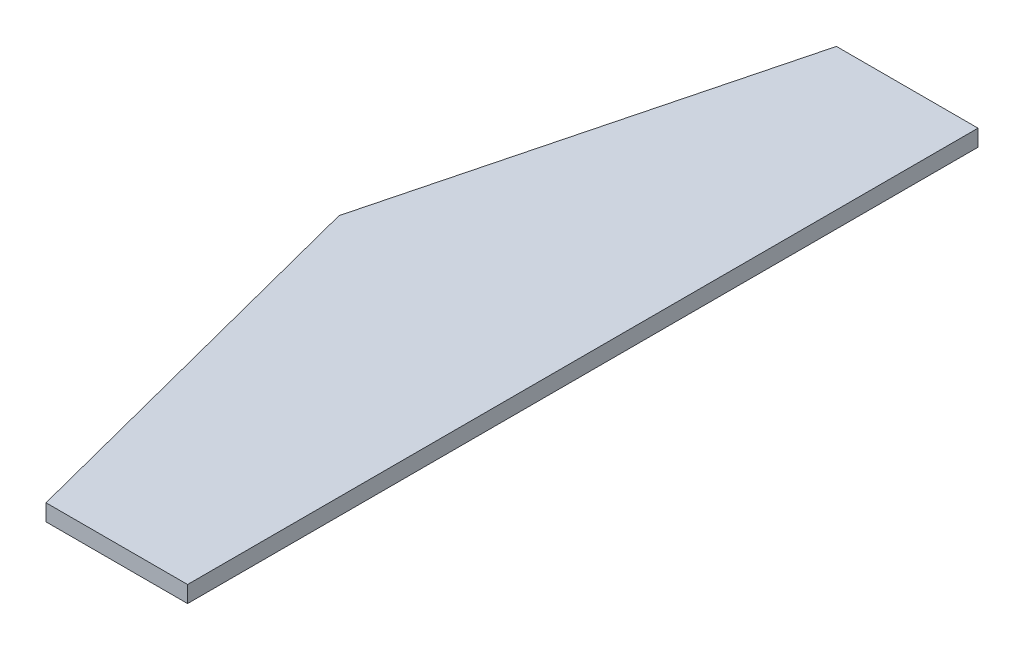
ISO-10303-21;
HEADER;
FILE_DESCRIPTION(('STEP AP214'),'2;1');
FILE_NAME('part.step','',(''),(''),'','','');
FILE_SCHEMA(('AUTOMOTIVE_DESIGN { 1 0 10303 214 1 1 1 1 }'));
ENDSEC;
DATA;
#1=APPLICATION_CONTEXT('core data for automotive mechanical design processes');
#2=APPLICATION_PROTOCOL_DEFINITION('international standard','automotive_design',2000,#1);
#3=PRODUCT_CONTEXT('',#1,'mechanical');
#4=PRODUCT('Part','Part','',(#3));
#5=PRODUCT_RELATED_PRODUCT_CATEGORY('part','',(#4));
#6=PRODUCT_DEFINITION_FORMATION('','',#4);
#7=PRODUCT_DEFINITION_CONTEXT('part definition',#1,'design');
#8=PRODUCT_DEFINITION('design','',#6,#7);
#9=PRODUCT_DEFINITION_SHAPE('','',#8);
#10=(LENGTH_UNIT() NAMED_UNIT(*) SI_UNIT(.MILLI.,.METRE.));
#11=(NAMED_UNIT(*) PLANE_ANGLE_UNIT() SI_UNIT($,.RADIAN.));
#12=(NAMED_UNIT(*) SI_UNIT($,.STERADIAN.) SOLID_ANGLE_UNIT());
#13=UNCERTAINTY_MEASURE_WITH_UNIT(LENGTH_MEASURE(1.E-05),#10,'distance_accuracy_value','');
#14=(GEOMETRIC_REPRESENTATION_CONTEXT(3) GLOBAL_UNCERTAINTY_ASSIGNED_CONTEXT((#13)) GLOBAL_UNIT_ASSIGNED_CONTEXT((#10,
#11,#12)) REPRESENTATION_CONTEXT('',''));
#15=CARTESIAN_POINT('',(0.,0.,0.));
#16=DIRECTION('',(0.,0.,1.));
#17=DIRECTION('',(1.,0.,0.));
#18=AXIS2_PLACEMENT_3D('',#15,#16,#17);
#19=CARTESIAN_POINT('',(-128.371735874381,15.,-430.296535076983));
#20=DIRECTION('',(0.,0.,1.));
#21=DIRECTION('',(1.,0.,0.));
#22=AXIS2_PLACEMENT_3D('',#19,#20,#21);
#23=PLANE('',#22);
#24=DIRECTION('',(-1.,0.,0.));
#25=VECTOR('',#24,1.);
#26=CARTESIAN_POINT('',(-128.371735874381,0.,-430.296535076983));
#27=LINE('',#26,#25);
#28=CARTESIAN_POINT('',(-5.76816563165183E-13,0.,-430.296535076982));
#29=VERTEX_POINT('',#28);
#30=CARTESIAN_POINT('',(-128.371735874381,0.,-430.296535076983));
#31=VERTEX_POINT('',#30);
#32=EDGE_CURVE('E107',#29,#31,#27,.T.);
#33=ORIENTED_EDGE('',*,*,#32,.T.);
#34=DIRECTION('',(0.,-1.,0.));
#35=VECTOR('',#34,1.);
#36=CARTESIAN_POINT('',(-128.371735874381,15.,-430.296535076983));
#37=LINE('',#36,#35);
#38=CARTESIAN_POINT('',(-128.371735874381,15.,-430.296535076983));
#39=VERTEX_POINT('',#38);
#40=EDGE_CURVE('E11',#39,#31,#37,.T.);
#41=ORIENTED_EDGE('',*,*,#40,.F.);
#42=DIRECTION('',(-1.,0.,0.));
#43=VECTOR('',#42,1.);
#44=CARTESIAN_POINT('',(-128.371735874381,15.,-430.296535076983));
#45=LINE('',#44,#43);
#46=CARTESIAN_POINT('',(-5.76816563165183E-13,15.,-430.296535076982));
#47=VERTEX_POINT('',#46);
#48=EDGE_CURVE('E115',#47,#39,#45,.T.);
#49=ORIENTED_EDGE('',*,*,#48,.F.);
#50=DIRECTION('',(0.,-1.,0.));
#51=VECTOR('',#50,1.);
#52=CARTESIAN_POINT('',(-5.76816563165183E-13,15.,-430.296535076982));
#53=LINE('',#52,#51);
#54=EDGE_CURVE('E103',#47,#29,#53,.T.);
#55=ORIENTED_EDGE('',*,*,#54,.T.);
#56=EDGE_LOOP('',(#33,#41,#49,#55));
#57=FACE_BOUND('',#56,.T.);
#58=ADVANCED_FACE('F33',(#57),#23,.F.);
#59=CARTESIAN_POINT('',(-220.987286506515,15.,-71.9465350769825));
#60=DIRECTION('',(0.968186963833413,0.,0.250227902247205));
#61=DIRECTION('',(0.250227902247205,0.,-0.968186963833413));
#62=AXIS2_PLACEMENT_3D('',#59,#60,#61);
#63=PLANE('',#62);
#64=DIRECTION('',(-0.250227902247205,0.,0.968186963833413));
#65=VECTOR('',#64,1.);
#66=CARTESIAN_POINT('',(-220.987286506515,0.,-71.9465350769825));
#67=LINE('',#66,#65);
#68=CARTESIAN_POINT('',(-220.987286506515,0.,-71.9465350769825));
#69=VERTEX_POINT('',#68);
#70=EDGE_CURVE('E110',#31,#69,#67,.T.);
#71=ORIENTED_EDGE('',*,*,#70,.T.);
#72=DIRECTION('',(0.,-1.,0.));
#73=VECTOR('',#72,1.);
#74=CARTESIAN_POINT('',(-220.987286506515,15.,-71.9465350769825));
#75=LINE('',#74,#73);
#76=CARTESIAN_POINT('',(-220.987286506515,15.,-71.9465350769825));
#77=VERTEX_POINT('',#76);
#78=EDGE_CURVE('E41',#77,#69,#75,.T.);
#79=ORIENTED_EDGE('',*,*,#78,.F.);
#80=DIRECTION('',(-0.250227902247205,0.,0.968186963833413));
#81=VECTOR('',#80,1.);
#82=CARTESIAN_POINT('',(-220.987286506515,15.,-71.9465350769825));
#83=LINE('',#82,#81);
#84=EDGE_CURVE('E83',#39,#77,#83,.T.);
#85=ORIENTED_EDGE('',*,*,#84,.F.);
#86=ORIENTED_EDGE('',*,*,#40,.T.);
#87=EDGE_LOOP('',(#71,#79,#85,#86));
#88=FACE_BOUND('',#87,.T.);
#89=ADVANCED_FACE('F134',(#88),#63,.F.);
#90=CARTESIAN_POINT('',(-128.371735874381,15.,286.403464923018));
#91=DIRECTION('',(0.968186963833413,0.,-0.250227902247205));
#92=DIRECTION('',(-0.250227902247205,0.,-0.968186963833413));
#93=AXIS2_PLACEMENT_3D('',#90,#91,#92);
#94=PLANE('',#93);
#95=DIRECTION('',(0.250227902247205,0.,0.968186963833413));
#96=VECTOR('',#95,1.);
#97=CARTESIAN_POINT('',(-128.371735874381,0.,286.403464923018));
#98=LINE('',#97,#96);
#99=CARTESIAN_POINT('',(-128.371735874381,0.,286.403464923018));
#100=VERTEX_POINT('',#99);
#101=EDGE_CURVE('E98',#69,#100,#98,.T.);
#102=ORIENTED_EDGE('',*,*,#101,.T.);
#103=DIRECTION('',(0.,-1.,0.));
#104=VECTOR('',#103,1.);
#105=CARTESIAN_POINT('',(-128.371735874381,15.,286.403464923018));
#106=LINE('',#105,#104);
#107=CARTESIAN_POINT('',(-128.371735874381,15.,286.403464923018));
#108=VERTEX_POINT('',#107);
#109=EDGE_CURVE('E95',#108,#100,#106,.T.);
#110=ORIENTED_EDGE('',*,*,#109,.F.);
#111=DIRECTION('',(0.250227902247205,0.,0.968186963833413));
#112=VECTOR('',#111,1.);
#113=CARTESIAN_POINT('',(-128.371735874381,15.,286.403464923018));
#114=LINE('',#113,#112);
#115=EDGE_CURVE('E87',#77,#108,#114,.T.);
#116=ORIENTED_EDGE('',*,*,#115,.F.);
#117=ORIENTED_EDGE('',*,*,#78,.T.);
#118=EDGE_LOOP('',(#102,#110,#116,#117));
#119=FACE_BOUND('',#118,.T.);
#120=ADVANCED_FACE('F96',(#119),#94,.F.);
#121=CARTESIAN_POINT('',(-5.76816563165183E-13,15.,286.403464923018));
#122=DIRECTION('',(0.,0.,-1.));
#123=DIRECTION('',(-1.,0.,0.));
#124=AXIS2_PLACEMENT_3D('',#121,#122,#123);
#125=PLANE('',#124);
#126=DIRECTION('',(1.,0.,0.));
#127=VECTOR('',#126,1.);
#128=CARTESIAN_POINT('',(-5.76816563165183E-13,0.,286.403464923018));
#129=LINE('',#128,#127);
#130=CARTESIAN_POINT('',(-5.76816563165183E-13,0.,286.403464923018));
#131=VERTEX_POINT('',#130);
#132=EDGE_CURVE('E69',#100,#131,#129,.T.);
#133=ORIENTED_EDGE('',*,*,#132,.T.);
#134=DIRECTION('',(0.,-1.,0.));
#135=VECTOR('',#134,1.);
#136=CARTESIAN_POINT('',(-5.76816563165183E-13,15.,286.403464923018));
#137=LINE('',#136,#135);
#138=CARTESIAN_POINT('',(-5.76816563165183E-13,15.,286.403464923018));
#139=VERTEX_POINT('',#138);
#140=EDGE_CURVE('E99',#139,#131,#137,.T.);
#141=ORIENTED_EDGE('',*,*,#140,.F.);
#142=DIRECTION('',(1.,0.,0.));
#143=VECTOR('',#142,1.);
#144=CARTESIAN_POINT('',(-5.76816563165183E-13,15.,286.403464923018));
#145=LINE('',#144,#143);
#146=EDGE_CURVE('E91',#108,#139,#145,.T.);
#147=ORIENTED_EDGE('',*,*,#146,.F.);
#148=ORIENTED_EDGE('',*,*,#109,.T.);
#149=EDGE_LOOP('',(#133,#141,#147,#148));
#150=FACE_BOUND('',#149,.T.);
#151=ADVANCED_FACE('F101',(#150),#125,.F.);
#152=CARTESIAN_POINT('',(-5.76816563165183E-13,15.,-430.296535076982));
#153=DIRECTION('',(-1.,0.,0.));
#154=DIRECTION('',(0.,0.,1.));
#155=AXIS2_PLACEMENT_3D('',#152,#153,#154);
#156=PLANE('',#155);
#157=DIRECTION('',(0.,0.,-1.));
#158=VECTOR('',#157,1.);
#159=CARTESIAN_POINT('',(-5.76816563165183E-13,0.,-430.296535076982));
#160=LINE('',#159,#158);
#161=EDGE_CURVE('E75',#131,#29,#160,.T.);
#162=ORIENTED_EDGE('',*,*,#161,.T.);
#163=ORIENTED_EDGE('',*,*,#54,.F.);
#164=DIRECTION('',(0.,0.,-1.));
#165=VECTOR('',#164,1.);
#166=CARTESIAN_POINT('',(-5.76816563165183E-13,15.,-430.296535076982));
#167=LINE('',#166,#165);
#168=EDGE_CURVE('E49',#139,#47,#167,.T.);
#169=ORIENTED_EDGE('',*,*,#168,.F.);
#170=ORIENTED_EDGE('',*,*,#140,.T.);
#171=EDGE_LOOP('',(#162,#163,#169,#170));
#172=FACE_BOUND('',#171,.T.);
#173=ADVANCED_FACE('F123',(#172),#156,.F.);
#174=CARTESIAN_POINT('',(0.,15.,0.));
#175=DIRECTION('',(0.,-1.,0.));
#176=DIRECTION('',(0.,0.,-1.));
#177=AXIS2_PLACEMENT_3D('',#174,#175,#176);
#178=PLANE('',#177);
#179=ORIENTED_EDGE('',*,*,#48,.T.);
#180=ORIENTED_EDGE('',*,*,#84,.T.);
#181=ORIENTED_EDGE('',*,*,#115,.T.);
#182=ORIENTED_EDGE('',*,*,#146,.T.);
#183=ORIENTED_EDGE('',*,*,#168,.T.);
#184=EDGE_LOOP('',(#179,#180,#181,#182,#183));
#185=FACE_BOUND('',#184,.T.);
#186=ADVANCED_FACE('F89',(#185),#178,.F.);
#187=CARTESIAN_POINT('',(0.,0.,0.));
#188=DIRECTION('',(0.,-1.,0.));
#189=DIRECTION('',(0.,0.,-1.));
#190=AXIS2_PLACEMENT_3D('',#187,#188,#189);
#191=PLANE('',#190);
#192=ORIENTED_EDGE('',*,*,#32,.F.);
#193=ORIENTED_EDGE('',*,*,#161,.F.);
#194=ORIENTED_EDGE('',*,*,#132,.F.);
#195=ORIENTED_EDGE('',*,*,#101,.F.);
#196=ORIENTED_EDGE('',*,*,#70,.F.);
#197=EDGE_LOOP('',(#192,#193,#194,#195,#196));
#198=FACE_BOUND('',#197,.T.);
#199=ADVANCED_FACE('F119',(#198),#191,.T.);
#200=CLOSED_SHELL('',(#58,#89,#120,#151,#173,#186,#199));
#201=MANIFOLD_SOLID_BREP('B2',#200);
#202=ADVANCED_BREP_SHAPE_REPRESENTATION('',(#18,#201),#14);
#203=SHAPE_DEFINITION_REPRESENTATION(#9,#202);
ENDSEC;
END-ISO-10303-21;
